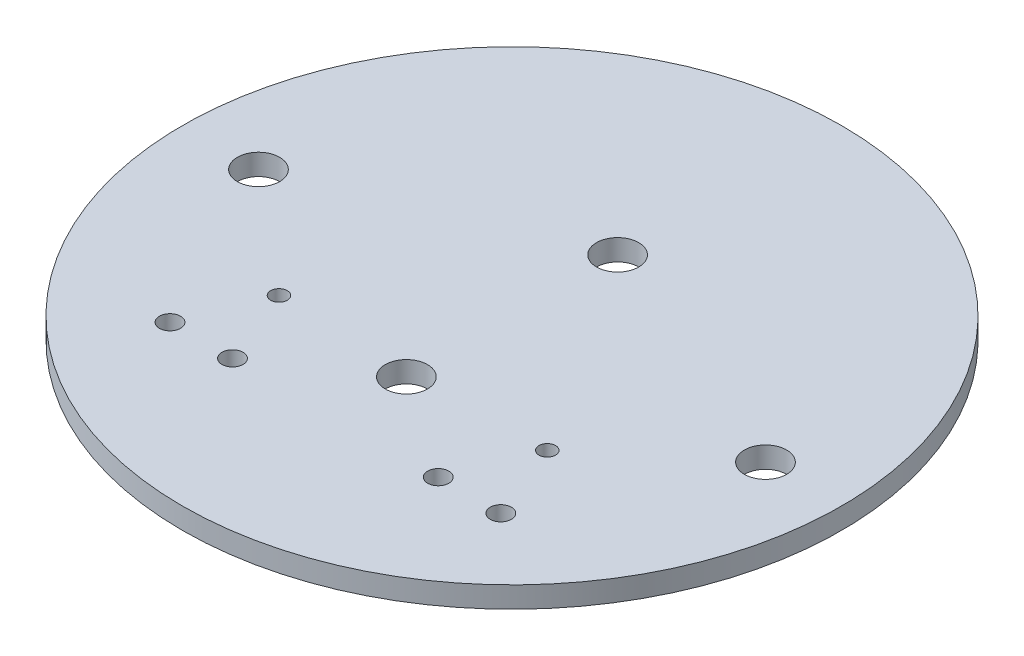
ISO-10303-21;
HEADER;
FILE_DESCRIPTION(('STEP AP214'),'2;1');
FILE_NAME('part.step','',(''),(''),'','','');
FILE_SCHEMA(('AUTOMOTIVE_DESIGN { 1 0 10303 214 1 1 1 1 }'));
ENDSEC;
DATA;
#1=APPLICATION_CONTEXT('core data for automotive mechanical design processes');
#2=APPLICATION_PROTOCOL_DEFINITION('international standard','automotive_design',2000,#1);
#3=PRODUCT_CONTEXT('',#1,'mechanical');
#4=PRODUCT('Part','Part','',(#3));
#5=PRODUCT_RELATED_PRODUCT_CATEGORY('part','',(#4));
#6=PRODUCT_DEFINITION_FORMATION('','',#4);
#7=PRODUCT_DEFINITION_CONTEXT('part definition',#1,'design');
#8=PRODUCT_DEFINITION('design','',#6,#7);
#9=PRODUCT_DEFINITION_SHAPE('','',#8);
#10=(LENGTH_UNIT() NAMED_UNIT(*) SI_UNIT(.MILLI.,.METRE.));
#11=(NAMED_UNIT(*) PLANE_ANGLE_UNIT() SI_UNIT($,.RADIAN.));
#12=(NAMED_UNIT(*) SI_UNIT($,.STERADIAN.) SOLID_ANGLE_UNIT());
#13=UNCERTAINTY_MEASURE_WITH_UNIT(LENGTH_MEASURE(1.E-05),#10,'distance_accuracy_value','');
#14=(GEOMETRIC_REPRESENTATION_CONTEXT(3) GLOBAL_UNCERTAINTY_ASSIGNED_CONTEXT((#13)) GLOBAL_UNIT_ASSIGNED_CONTEXT((#10,
#11,#12)) REPRESENTATION_CONTEXT('',''));
#15=CARTESIAN_POINT('',(0.,0.,0.));
#16=DIRECTION('',(0.,0.,1.));
#17=DIRECTION('',(1.,0.,0.));
#18=AXIS2_PLACEMENT_3D('',#15,#16,#17);
#19=CARTESIAN_POINT('',(0.,3.175,0.));
#20=DIRECTION('',(0.,-1.,0.));
#21=DIRECTION('',(0.,0.,-1.));
#22=AXIS2_PLACEMENT_3D('',#19,#20,#21);
#23=CYLINDRICAL_SURFACE('',#22,49.53);
#24=CARTESIAN_POINT('',(0.,3.175,0.));
#25=DIRECTION('',(0.,1.,0.));
#26=DIRECTION('',(0.,0.,1.));
#27=AXIS2_PLACEMENT_3D('',#24,#25,#26);
#28=CIRCLE('',#27,49.53);
#29=CARTESIAN_POINT('',(0.,3.175,49.53));
#30=VERTEX_POINT('',#29);
#31=EDGE_CURVE('E10',#30,#30,#28,.T.);
#32=ORIENTED_EDGE('',*,*,#31,.F.);
#33=EDGE_LOOP('',(#32));
#34=FACE_BOUND('',#33,.T.);
#35=CARTESIAN_POINT('',(0.,0.,0.));
#36=DIRECTION('',(0.,1.,0.));
#37=DIRECTION('',(0.,0.,1.));
#38=AXIS2_PLACEMENT_3D('',#35,#36,#37);
#39=CIRCLE('',#38,49.53);
#40=CARTESIAN_POINT('',(0.,0.,49.53));
#41=VERTEX_POINT('',#40);
#42=EDGE_CURVE('E37',#41,#41,#39,.T.);
#43=ORIENTED_EDGE('',*,*,#42,.T.);
#44=EDGE_LOOP('',(#43));
#45=FACE_BOUND('',#44,.T.);
#46=ADVANCED_FACE('F30',(#34,#45),#23,.T.);
#47=CARTESIAN_POINT('',(0.,3.175,0.));
#48=DIRECTION('',(0.,1.,0.));
#49=DIRECTION('',(0.,0.,1.));
#50=AXIS2_PLACEMENT_3D('',#47,#48,#49);
#51=PLANE('',#50);
#52=CARTESIAN_POINT('',(-24.86025,3.175,26.5429999999999));
#53=DIRECTION('',(0.,1.,0.));
#54=DIRECTION('',(0.,0.,1.));
#55=AXIS2_PLACEMENT_3D('',#52,#53,#54);
#56=CIRCLE('',#55,1.5875);
#57=CARTESIAN_POINT('',(-24.86025,3.175,28.1304999999999));
#58=VERTEX_POINT('',#57);
#59=EDGE_CURVE('E65',#58,#58,#56,.T.);
#60=ORIENTED_EDGE('',*,*,#59,.F.);
#61=EDGE_LOOP('',(#60));
#62=FACE_BOUND('',#61,.T.);
#63=CARTESIAN_POINT('',(-15.46225,3.175,26.5429999999999));
#64=DIRECTION('',(0.,1.,0.));
#65=DIRECTION('',(0.,0.,1.));
#66=AXIS2_PLACEMENT_3D('',#63,#64,#65);
#67=CIRCLE('',#66,1.5875);
#68=CARTESIAN_POINT('',(-15.46225,3.175,28.1304999999999));
#69=VERTEX_POINT('',#68);
#70=EDGE_CURVE('E70',#69,#69,#67,.T.);
#71=ORIENTED_EDGE('',*,*,#70,.F.);
#72=EDGE_LOOP('',(#71));
#73=FACE_BOUND('',#72,.T.);
#74=CARTESIAN_POINT('',(15.46225,3.175,26.5429999999999));
#75=DIRECTION('',(0.,1.,0.));
#76=DIRECTION('',(0.,0.,1.));
#77=AXIS2_PLACEMENT_3D('',#74,#75,#76);
#78=CIRCLE('',#77,1.5875);
#79=CARTESIAN_POINT('',(15.46225,3.175,28.1304999999999));
#80=VERTEX_POINT('',#79);
#81=EDGE_CURVE('E73',#80,#80,#78,.T.);
#82=ORIENTED_EDGE('',*,*,#81,.F.);
#83=EDGE_LOOP('',(#82));
#84=FACE_BOUND('',#83,.T.);
#85=CARTESIAN_POINT('',(24.86025,3.175,26.5429999999999));
#86=DIRECTION('',(0.,1.,0.));
#87=DIRECTION('',(0.,0.,1.));
#88=AXIS2_PLACEMENT_3D('',#85,#86,#87);
#89=CIRCLE('',#88,1.5875);
#90=CARTESIAN_POINT('',(24.86025,3.175,28.1304999999999));
#91=VERTEX_POINT('',#90);
#92=EDGE_CURVE('E76',#91,#91,#89,.T.);
#93=ORIENTED_EDGE('',*,*,#92,.F.);
#94=EDGE_LOOP('',(#93));
#95=FACE_BOUND('',#94,.T.);
#96=CARTESIAN_POINT('',(20.16125,3.175,14.859));
#97=DIRECTION('',(0.,1.,0.));
#98=DIRECTION('',(0.,0.,1.));
#99=AXIS2_PLACEMENT_3D('',#96,#97,#98);
#100=CIRCLE('',#99,1.25);
#101=CARTESIAN_POINT('',(20.16125,3.175,16.109));
#102=VERTEX_POINT('',#101);
#103=EDGE_CURVE('E79',#102,#102,#100,.T.);
#104=ORIENTED_EDGE('',*,*,#103,.F.);
#105=EDGE_LOOP('',(#104));
#106=FACE_BOUND('',#105,.T.);
#107=CARTESIAN_POINT('',(-20.16125,3.175,14.8589999999999));
#108=DIRECTION('',(0.,1.,0.));
#109=DIRECTION('',(0.,0.,1.));
#110=AXIS2_PLACEMENT_3D('',#107,#108,#109);
#111=CIRCLE('',#110,1.25);
#112=CARTESIAN_POINT('',(-20.16125,3.175,16.1089999999999));
#113=VERTEX_POINT('',#112);
#114=EDGE_CURVE('E82',#113,#113,#111,.T.);
#115=ORIENTED_EDGE('',*,*,#114,.F.);
#116=EDGE_LOOP('',(#115));
#117=FACE_BOUND('',#116,.T.);
#118=CARTESIAN_POINT('',(0.,3.175,15.875));
#119=DIRECTION('',(0.,1.,0.));
#120=DIRECTION('',(0.,0.,1.));
#121=AXIS2_PLACEMENT_3D('',#118,#119,#120);
#122=CIRCLE('',#121,3.175);
#123=CARTESIAN_POINT('',(0.,3.175,19.05));
#124=VERTEX_POINT('',#123);
#125=EDGE_CURVE('E49',#124,#124,#122,.T.);
#126=ORIENTED_EDGE('',*,*,#125,.F.);
#127=EDGE_LOOP('',(#126));
#128=FACE_BOUND('',#127,.T.);
#129=CARTESIAN_POINT('',(0.,3.175,-15.875));
#130=DIRECTION('',(0.,1.,0.));
#131=DIRECTION('',(0.,0.,1.));
#132=AXIS2_PLACEMENT_3D('',#129,#130,#131);
#133=CIRCLE('',#132,3.175);
#134=CARTESIAN_POINT('',(0.,3.175,-12.7));
#135=VERTEX_POINT('',#134);
#136=EDGE_CURVE('E54',#135,#135,#133,.T.);
#137=ORIENTED_EDGE('',*,*,#136,.F.);
#138=EDGE_LOOP('',(#137));
#139=FACE_BOUND('',#138,.T.);
#140=CARTESIAN_POINT('',(38.1,3.175,0.));
#141=DIRECTION('',(0.,1.,0.));
#142=DIRECTION('',(0.,0.,1.));
#143=AXIS2_PLACEMENT_3D('',#140,#141,#142);
#144=CIRCLE('',#143,3.175);
#145=CARTESIAN_POINT('',(38.1,3.175,3.17499999999998));
#146=VERTEX_POINT('',#145);
#147=EDGE_CURVE('E42',#146,#146,#144,.T.);
#148=ORIENTED_EDGE('',*,*,#147,.F.);
#149=EDGE_LOOP('',(#148));
#150=FACE_BOUND('',#149,.T.);
#151=CARTESIAN_POINT('',(-38.1,3.175,0.));
#152=DIRECTION('',(0.,1.,0.));
#153=DIRECTION('',(0.,0.,1.));
#154=AXIS2_PLACEMENT_3D('',#151,#152,#153);
#155=CIRCLE('',#154,3.175);
#156=CARTESIAN_POINT('',(-38.1,3.175,3.17500000000001));
#157=VERTEX_POINT('',#156);
#158=EDGE_CURVE('E48',#157,#157,#155,.T.);
#159=ORIENTED_EDGE('',*,*,#158,.F.);
#160=EDGE_LOOP('',(#159));
#161=FACE_BOUND('',#160,.T.);
#162=ORIENTED_EDGE('',*,*,#31,.T.);
#163=EDGE_LOOP('',(#162));
#164=FACE_BOUND('',#163,.T.);
#165=ADVANCED_FACE('F110',(#62,#73,#84,#95,#106,#117,#128,#139,#150,#161,#164),#51,.T.);
#166=CARTESIAN_POINT('',(0.,0.,0.));
#167=DIRECTION('',(0.,1.,0.));
#168=DIRECTION('',(0.,0.,1.));
#169=AXIS2_PLACEMENT_3D('',#166,#167,#168);
#170=PLANE('',#169);
#171=CARTESIAN_POINT('',(-24.86025,0.,26.5429999999999));
#172=DIRECTION('',(0.,-1.,0.));
#173=DIRECTION('',(0.,0.,-1.));
#174=AXIS2_PLACEMENT_3D('',#171,#172,#173);
#175=CIRCLE('',#174,1.5875);
#176=CARTESIAN_POINT('',(-24.86025,0.,24.9554999999999));
#177=VERTEX_POINT('',#176);
#178=EDGE_CURVE('E85',#177,#177,#175,.T.);
#179=ORIENTED_EDGE('',*,*,#178,.F.);
#180=EDGE_LOOP('',(#179));
#181=FACE_BOUND('',#180,.T.);
#182=CARTESIAN_POINT('',(-15.46225,0.,26.5429999999999));
#183=DIRECTION('',(0.,-1.,0.));
#184=DIRECTION('',(0.,0.,-1.));
#185=AXIS2_PLACEMENT_3D('',#182,#183,#184);
#186=CIRCLE('',#185,1.5875);
#187=CARTESIAN_POINT('',(-15.46225,0.,24.9554999999999));
#188=VERTEX_POINT('',#187);
#189=EDGE_CURVE('E98',#188,#188,#186,.T.);
#190=ORIENTED_EDGE('',*,*,#189,.F.);
#191=EDGE_LOOP('',(#190));
#192=FACE_BOUND('',#191,.T.);
#193=CARTESIAN_POINT('',(15.46225,0.,26.5429999999999));
#194=DIRECTION('',(0.,-1.,0.));
#195=DIRECTION('',(0.,0.,-1.));
#196=AXIS2_PLACEMENT_3D('',#193,#194,#195);
#197=CIRCLE('',#196,1.5875);
#198=CARTESIAN_POINT('',(15.46225,0.,24.9554999999999));
#199=VERTEX_POINT('',#198);
#200=EDGE_CURVE('E95',#199,#199,#197,.T.);
#201=ORIENTED_EDGE('',*,*,#200,.F.);
#202=EDGE_LOOP('',(#201));
#203=FACE_BOUND('',#202,.T.);
#204=CARTESIAN_POINT('',(24.86025,0.,26.5429999999999));
#205=DIRECTION('',(0.,-1.,0.));
#206=DIRECTION('',(0.,0.,-1.));
#207=AXIS2_PLACEMENT_3D('',#204,#205,#206);
#208=CIRCLE('',#207,1.5875);
#209=CARTESIAN_POINT('',(24.86025,0.,24.9554999999999));
#210=VERTEX_POINT('',#209);
#211=EDGE_CURVE('E92',#210,#210,#208,.T.);
#212=ORIENTED_EDGE('',*,*,#211,.F.);
#213=EDGE_LOOP('',(#212));
#214=FACE_BOUND('',#213,.T.);
#215=CARTESIAN_POINT('',(20.16125,0.,14.859));
#216=DIRECTION('',(0.,-1.,0.));
#217=DIRECTION('',(0.,0.,-1.));
#218=AXIS2_PLACEMENT_3D('',#215,#216,#217);
#219=CIRCLE('',#218,1.25);
#220=CARTESIAN_POINT('',(20.16125,0.,13.609));
#221=VERTEX_POINT('',#220);
#222=EDGE_CURVE('E89',#221,#221,#219,.T.);
#223=ORIENTED_EDGE('',*,*,#222,.F.);
#224=EDGE_LOOP('',(#223));
#225=FACE_BOUND('',#224,.T.);
#226=CARTESIAN_POINT('',(-20.16125,0.,14.8589999999999));
#227=DIRECTION('',(0.,-1.,0.));
#228=DIRECTION('',(0.,0.,-1.));
#229=AXIS2_PLACEMENT_3D('',#226,#227,#228);
#230=CIRCLE('',#229,1.25);
#231=CARTESIAN_POINT('',(-20.16125,0.,13.6089999999999));
#232=VERTEX_POINT('',#231);
#233=EDGE_CURVE('E86',#232,#232,#230,.T.);
#234=ORIENTED_EDGE('',*,*,#233,.F.);
#235=EDGE_LOOP('',(#234));
#236=FACE_BOUND('',#235,.T.);
#237=CARTESIAN_POINT('',(0.,0.,15.875));
#238=DIRECTION('',(0.,-1.,0.));
#239=DIRECTION('',(0.,0.,-1.));
#240=AXIS2_PLACEMENT_3D('',#237,#238,#239);
#241=CIRCLE('',#240,3.175);
#242=CARTESIAN_POINT('',(0.,0.,12.7));
#243=VERTEX_POINT('',#242);
#244=EDGE_CURVE('E59',#243,#243,#241,.T.);
#245=ORIENTED_EDGE('',*,*,#244,.F.);
#246=EDGE_LOOP('',(#245));
#247=FACE_BOUND('',#246,.T.);
#248=CARTESIAN_POINT('',(0.,0.,-15.875));
#249=DIRECTION('',(0.,-1.,0.));
#250=DIRECTION('',(0.,0.,-1.));
#251=AXIS2_PLACEMENT_3D('',#248,#249,#250);
#252=CIRCLE('',#251,3.175);
#253=CARTESIAN_POINT('',(0.,0.,-19.05));
#254=VERTEX_POINT('',#253);
#255=EDGE_CURVE('E62',#254,#254,#252,.T.);
#256=ORIENTED_EDGE('',*,*,#255,.F.);
#257=EDGE_LOOP('',(#256));
#258=FACE_BOUND('',#257,.T.);
#259=CARTESIAN_POINT('',(38.1,0.,0.));
#260=DIRECTION('',(0.,1.,0.));
#261=DIRECTION('',(0.,0.,1.));
#262=AXIS2_PLACEMENT_3D('',#259,#260,#261);
#263=CIRCLE('',#262,3.175);
#264=CARTESIAN_POINT('',(38.1,0.,3.17499999999998));
#265=VERTEX_POINT('',#264);
#266=EDGE_CURVE('E33',#265,#265,#263,.T.);
#267=ORIENTED_EDGE('',*,*,#266,.T.);
#268=EDGE_LOOP('',(#267));
#269=FACE_BOUND('',#268,.T.);
#270=CARTESIAN_POINT('',(-38.1,0.,0.));
#271=DIRECTION('',(0.,1.,0.));
#272=DIRECTION('',(0.,0.,1.));
#273=AXIS2_PLACEMENT_3D('',#270,#271,#272);
#274=CIRCLE('',#273,3.175);
#275=CARTESIAN_POINT('',(-38.1,0.,3.17500000000001));
#276=VERTEX_POINT('',#275);
#277=EDGE_CURVE('E46',#276,#276,#274,.T.);
#278=ORIENTED_EDGE('',*,*,#277,.T.);
#279=EDGE_LOOP('',(#278));
#280=FACE_BOUND('',#279,.T.);
#281=ORIENTED_EDGE('',*,*,#42,.F.);
#282=EDGE_LOOP('',(#281));
#283=FACE_BOUND('',#282,.T.);
#284=ADVANCED_FACE('F106',(#181,#192,#203,#214,#225,#236,#247,#258,#269,#280,#283),#170,.F.);
#285=CARTESIAN_POINT('',(-38.1,-28.448,0.));
#286=DIRECTION('',(0.,1.,0.));
#287=DIRECTION('',(0.,0.,1.));
#288=AXIS2_PLACEMENT_3D('',#285,#286,#287);
#289=CYLINDRICAL_SURFACE('',#288,3.175);
#290=ORIENTED_EDGE('',*,*,#158,.T.);
#291=EDGE_LOOP('',(#290));
#292=FACE_BOUND('',#291,.T.);
#293=ORIENTED_EDGE('',*,*,#277,.F.);
#294=EDGE_LOOP('',(#293));
#295=FACE_BOUND('',#294,.T.);
#296=ADVANCED_FACE('F109',(#292,#295),#289,.F.);
#297=CARTESIAN_POINT('',(38.1,-28.448,0.));
#298=DIRECTION('',(0.,1.,0.));
#299=DIRECTION('',(0.,0.,1.));
#300=AXIS2_PLACEMENT_3D('',#297,#298,#299);
#301=CYLINDRICAL_SURFACE('',#300,3.175);
#302=ORIENTED_EDGE('',*,*,#147,.T.);
#303=EDGE_LOOP('',(#302));
#304=FACE_BOUND('',#303,.T.);
#305=ORIENTED_EDGE('',*,*,#266,.F.);
#306=EDGE_LOOP('',(#305));
#307=FACE_BOUND('',#306,.T.);
#308=ADVANCED_FACE('F145',(#304,#307),#301,.F.);
#309=CARTESIAN_POINT('',(0.,25.4,-15.875));
#310=DIRECTION('',(0.,-1.,0.));
#311=DIRECTION('',(0.,0.,-1.));
#312=AXIS2_PLACEMENT_3D('',#309,#310,#311);
#313=CYLINDRICAL_SURFACE('',#312,3.175);
#314=ORIENTED_EDGE('',*,*,#136,.T.);
#315=EDGE_LOOP('',(#314));
#316=FACE_BOUND('',#315,.T.);
#317=ORIENTED_EDGE('',*,*,#255,.T.);
#318=EDGE_LOOP('',(#317));
#319=FACE_BOUND('',#318,.T.);
#320=ADVANCED_FACE('F149',(#316,#319),#313,.F.);
#321=CARTESIAN_POINT('',(0.,25.4,15.875));
#322=DIRECTION('',(0.,-1.,0.));
#323=DIRECTION('',(0.,0.,-1.));
#324=AXIS2_PLACEMENT_3D('',#321,#322,#323);
#325=CYLINDRICAL_SURFACE('',#324,3.175);
#326=ORIENTED_EDGE('',*,*,#125,.T.);
#327=EDGE_LOOP('',(#326));
#328=FACE_BOUND('',#327,.T.);
#329=ORIENTED_EDGE('',*,*,#244,.T.);
#330=EDGE_LOOP('',(#329));
#331=FACE_BOUND('',#330,.T.);
#332=ADVANCED_FACE('F153',(#328,#331),#325,.F.);
#333=CARTESIAN_POINT('',(-20.16125,50.8,14.8589999999999));
#334=DIRECTION('',(0.,-1.,0.));
#335=DIRECTION('',(0.,0.,-1.));
#336=AXIS2_PLACEMENT_3D('',#333,#334,#335);
#337=CYLINDRICAL_SURFACE('',#336,1.25);
#338=ORIENTED_EDGE('',*,*,#114,.T.);
#339=EDGE_LOOP('',(#338));
#340=FACE_BOUND('',#339,.T.);
#341=ORIENTED_EDGE('',*,*,#233,.T.);
#342=EDGE_LOOP('',(#341));
#343=FACE_BOUND('',#342,.T.);
#344=ADVANCED_FACE('F157',(#340,#343),#337,.F.);
#345=CARTESIAN_POINT('',(20.16125,50.8,14.859));
#346=DIRECTION('',(0.,-1.,0.));
#347=DIRECTION('',(0.,0.,-1.));
#348=AXIS2_PLACEMENT_3D('',#345,#346,#347);
#349=CYLINDRICAL_SURFACE('',#348,1.25);
#350=ORIENTED_EDGE('',*,*,#103,.T.);
#351=EDGE_LOOP('',(#350));
#352=FACE_BOUND('',#351,.T.);
#353=ORIENTED_EDGE('',*,*,#222,.T.);
#354=EDGE_LOOP('',(#353));
#355=FACE_BOUND('',#354,.T.);
#356=ADVANCED_FACE('F160',(#352,#355),#349,.F.);
#357=CARTESIAN_POINT('',(24.86025,50.8,26.5429999999999));
#358=DIRECTION('',(0.,-1.,0.));
#359=DIRECTION('',(0.,0.,-1.));
#360=AXIS2_PLACEMENT_3D('',#357,#358,#359);
#361=CYLINDRICAL_SURFACE('',#360,1.5875);
#362=ORIENTED_EDGE('',*,*,#92,.T.);
#363=EDGE_LOOP('',(#362));
#364=FACE_BOUND('',#363,.T.);
#365=ORIENTED_EDGE('',*,*,#211,.T.);
#366=EDGE_LOOP('',(#365));
#367=FACE_BOUND('',#366,.T.);
#368=ADVANCED_FACE('F164',(#364,#367),#361,.F.);
#369=CARTESIAN_POINT('',(15.46225,50.8,26.5429999999999));
#370=DIRECTION('',(0.,-1.,0.));
#371=DIRECTION('',(0.,0.,-1.));
#372=AXIS2_PLACEMENT_3D('',#369,#370,#371);
#373=CYLINDRICAL_SURFACE('',#372,1.5875);
#374=ORIENTED_EDGE('',*,*,#81,.T.);
#375=EDGE_LOOP('',(#374));
#376=FACE_BOUND('',#375,.T.);
#377=ORIENTED_EDGE('',*,*,#200,.T.);
#378=EDGE_LOOP('',(#377));
#379=FACE_BOUND('',#378,.T.);
#380=ADVANCED_FACE('F168',(#376,#379),#373,.F.);
#381=CARTESIAN_POINT('',(-15.46225,50.8,26.5429999999999));
#382=DIRECTION('',(0.,-1.,0.));
#383=DIRECTION('',(0.,0.,-1.));
#384=AXIS2_PLACEMENT_3D('',#381,#382,#383);
#385=CYLINDRICAL_SURFACE('',#384,1.5875);
#386=ORIENTED_EDGE('',*,*,#70,.T.);
#387=EDGE_LOOP('',(#386));
#388=FACE_BOUND('',#387,.T.);
#389=ORIENTED_EDGE('',*,*,#189,.T.);
#390=EDGE_LOOP('',(#389));
#391=FACE_BOUND('',#390,.T.);
#392=ADVANCED_FACE('F172',(#388,#391),#385,.F.);
#393=CARTESIAN_POINT('',(-24.86025,50.8,26.5429999999999));
#394=DIRECTION('',(0.,-1.,0.));
#395=DIRECTION('',(0.,0.,-1.));
#396=AXIS2_PLACEMENT_3D('',#393,#394,#395);
#397=CYLINDRICAL_SURFACE('',#396,1.5875);
#398=ORIENTED_EDGE('',*,*,#59,.T.);
#399=EDGE_LOOP('',(#398));
#400=FACE_BOUND('',#399,.T.);
#401=ORIENTED_EDGE('',*,*,#178,.T.);
#402=EDGE_LOOP('',(#401));
#403=FACE_BOUND('',#402,.T.);
#404=ADVANCED_FACE('F104',(#400,#403),#397,.F.);
#405=CLOSED_SHELL('',(#46,#165,#284,#296,#308,#320,#332,#344,#356,#368,#380,#392,#404));
#406=MANIFOLD_SOLID_BREP('B2',#405);
#407=ADVANCED_BREP_SHAPE_REPRESENTATION('',(#18,#406),#14);
#408=SHAPE_DEFINITION_REPRESENTATION(#9,#407);
ENDSEC;
END-ISO-10303-21;
